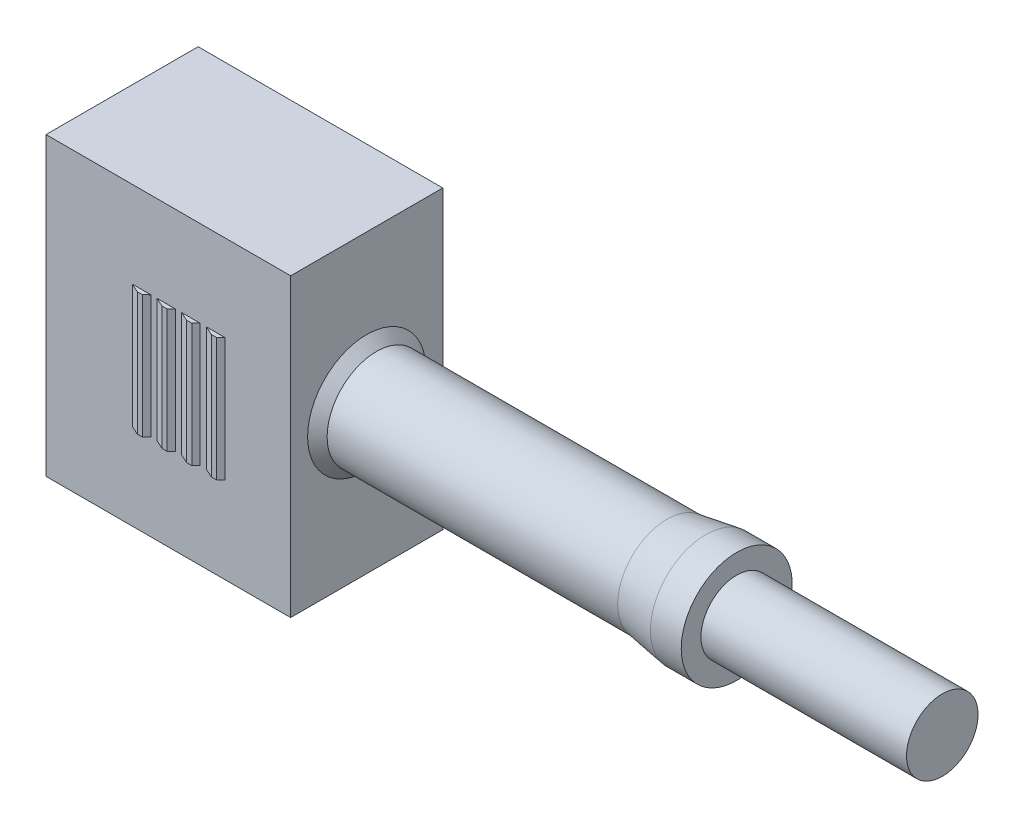
ISO-10303-21;
HEADER;
FILE_DESCRIPTION(('STEP AP214'),'2;1');
FILE_NAME('part.step','',(''),(''),'','','');
FILE_SCHEMA(('AUTOMOTIVE_DESIGN { 1 0 10303 214 1 1 1 1 }'));
ENDSEC;
DATA;
#1=APPLICATION_CONTEXT('core data for automotive mechanical design processes');
#2=APPLICATION_PROTOCOL_DEFINITION('international standard','automotive_design',2000,#1);
#3=PRODUCT_CONTEXT('',#1,'mechanical');
#4=PRODUCT('Part','Part','',(#3));
#5=PRODUCT_RELATED_PRODUCT_CATEGORY('part','',(#4));
#6=PRODUCT_DEFINITION_FORMATION('','',#4);
#7=PRODUCT_DEFINITION_CONTEXT('part definition',#1,'design');
#8=PRODUCT_DEFINITION('design','',#6,#7);
#9=PRODUCT_DEFINITION_SHAPE('','',#8);
#10=(LENGTH_UNIT() NAMED_UNIT(*) SI_UNIT(.MILLI.,.METRE.));
#11=(NAMED_UNIT(*) PLANE_ANGLE_UNIT() SI_UNIT($,.RADIAN.));
#12=(NAMED_UNIT(*) SI_UNIT($,.STERADIAN.) SOLID_ANGLE_UNIT());
#13=UNCERTAINTY_MEASURE_WITH_UNIT(LENGTH_MEASURE(1.E-05),#10,'distance_accuracy_value','');
#14=(GEOMETRIC_REPRESENTATION_CONTEXT(3) GLOBAL_UNCERTAINTY_ASSIGNED_CONTEXT((#13)) GLOBAL_UNIT_ASSIGNED_CONTEXT((#10,
#11,#12)) REPRESENTATION_CONTEXT('',''));
#15=CARTESIAN_POINT('',(0.,0.,0.));
#16=DIRECTION('',(0.,0.,1.));
#17=DIRECTION('',(1.,0.,0.));
#18=AXIS2_PLACEMENT_3D('',#15,#16,#17);
#19=CARTESIAN_POINT('',(5.95,-7.2,3.7));
#20=DIRECTION('',(-1.,0.,0.));
#21=DIRECTION('',(0.,0.,1.));
#22=AXIS2_PLACEMENT_3D('',#19,#20,#21);
#23=PLANE('',#22);
#24=DIRECTION('',(0.,1.,0.));
#25=VECTOR('',#24,1.);
#26=CARTESIAN_POINT('',(5.95,-7.2,-3.7));
#27=LINE('',#26,#25);
#28=CARTESIAN_POINT('',(5.95,-7.2,-3.7));
#29=VERTEX_POINT('',#28);
#30=CARTESIAN_POINT('',(5.95,7.2,-3.7));
#31=VERTEX_POINT('',#30);
#32=EDGE_CURVE('E384',#29,#31,#27,.T.);
#33=ORIENTED_EDGE('',*,*,#32,.T.);
#34=DIRECTION('',(0.,0.,-1.));
#35=VECTOR('',#34,1.);
#36=CARTESIAN_POINT('',(5.95,7.2,3.7));
#37=LINE('',#36,#35);
#38=CARTESIAN_POINT('',(5.95,7.2,3.7));
#39=VERTEX_POINT('',#38);
#40=EDGE_CURVE('E389',#39,#31,#37,.T.);
#41=ORIENTED_EDGE('',*,*,#40,.F.);
#42=DIRECTION('',(0.,1.,0.));
#43=VECTOR('',#42,1.);
#44=CARTESIAN_POINT('',(5.95,-7.2,3.7));
#45=LINE('',#44,#43);
#46=CARTESIAN_POINT('',(5.95,-7.2,3.7));
#47=VERTEX_POINT('',#46);
#48=EDGE_CURVE('E375',#47,#39,#45,.T.);
#49=ORIENTED_EDGE('',*,*,#48,.F.);
#50=DIRECTION('',(0.,0.,-1.));
#51=VECTOR('',#50,1.);
#52=CARTESIAN_POINT('',(5.95,-7.2,3.7));
#53=LINE('',#52,#51);
#54=EDGE_CURVE('E392',#47,#29,#53,.T.);
#55=ORIENTED_EDGE('',*,*,#54,.T.);
#56=EDGE_LOOP('',(#33,#41,#49,#55));
#57=FACE_BOUND('',#56,.T.);
#58=CARTESIAN_POINT('',(5.95,0.,0.));
#59=DIRECTION('',(-1.,0.,0.));
#60=DIRECTION('',(0.,0.,1.));
#61=AXIS2_PLACEMENT_3D('',#58,#59,#60);
#62=CIRCLE('',#61,2.875);
#63=CARTESIAN_POINT('',(5.95,0.,2.875));
#64=VERTEX_POINT('',#63);
#65=EDGE_CURVE('E11',#64,#64,#62,.F.);
#66=ORIENTED_EDGE('',*,*,#65,.F.);
#67=EDGE_LOOP('',(#66));
#68=FACE_BOUND('',#67,.T.);
#69=ADVANCED_FACE('F31',(#57,#68),#23,.F.);
#70=CARTESIAN_POINT('',(-5.95,-7.2,3.7));
#71=DIRECTION('',(1.,0.,0.));
#72=DIRECTION('',(0.,0.,-1.));
#73=AXIS2_PLACEMENT_3D('',#70,#71,#72);
#74=PLANE('',#73);
#75=DIRECTION('',(0.,0.,1.));
#76=VECTOR('',#75,1.);
#77=CARTESIAN_POINT('',(-5.95,-6.4,2.8));
#78=LINE('',#77,#76);
#79=CARTESIAN_POINT('',(-5.95,-6.4,-2.8));
#80=VERTEX_POINT('',#79);
#81=CARTESIAN_POINT('',(-5.95,-6.4,2.8));
#82=VERTEX_POINT('',#81);
#83=EDGE_CURVE('E222',#80,#82,#78,.T.);
#84=ORIENTED_EDGE('',*,*,#83,.F.);
#85=DIRECTION('',(0.,-1.,0.));
#86=VECTOR('',#85,1.);
#87=CARTESIAN_POINT('',(-5.95,-6.4,-2.8));
#88=LINE('',#87,#86);
#89=CARTESIAN_POINT('',(-5.95,6.4,-2.8));
#90=VERTEX_POINT('',#89);
#91=EDGE_CURVE('E46',#90,#80,#88,.T.);
#92=ORIENTED_EDGE('',*,*,#91,.F.);
#93=DIRECTION('',(0.,0.,-1.));
#94=VECTOR('',#93,1.);
#95=CARTESIAN_POINT('',(-5.95,6.4,2.8));
#96=LINE('',#95,#94);
#97=CARTESIAN_POINT('',(-5.95,6.4,2.8));
#98=VERTEX_POINT('',#97);
#99=EDGE_CURVE('E213',#98,#90,#96,.T.);
#100=ORIENTED_EDGE('',*,*,#99,.F.);
#101=DIRECTION('',(0.,1.,0.));
#102=VECTOR('',#101,1.);
#103=CARTESIAN_POINT('',(-5.95,-6.4,2.8));
#104=LINE('',#103,#102);
#105=EDGE_CURVE('E216',#82,#98,#104,.T.);
#106=ORIENTED_EDGE('',*,*,#105,.F.);
#107=EDGE_LOOP('',(#84,#92,#100,#106));
#108=FACE_BOUND('',#107,.T.);
#109=DIRECTION('',(0.,-1.,0.));
#110=VECTOR('',#109,1.);
#111=CARTESIAN_POINT('',(-5.95,-7.2,-3.7));
#112=LINE('',#111,#110);
#113=CARTESIAN_POINT('',(-5.95,7.2,-3.7));
#114=VERTEX_POINT('',#113);
#115=CARTESIAN_POINT('',(-5.95,-7.2,-3.7));
#116=VERTEX_POINT('',#115);
#117=EDGE_CURVE('E368',#114,#116,#112,.T.);
#118=ORIENTED_EDGE('',*,*,#117,.T.);
#119=DIRECTION('',(0.,0.,-1.));
#120=VECTOR('',#119,1.);
#121=CARTESIAN_POINT('',(-5.95,-7.2,3.7));
#122=LINE('',#121,#120);
#123=CARTESIAN_POINT('',(-5.95,-7.2,3.7));
#124=VERTEX_POINT('',#123);
#125=EDGE_CURVE('E39',#124,#116,#122,.T.);
#126=ORIENTED_EDGE('',*,*,#125,.F.);
#127=DIRECTION('',(0.,-1.,0.));
#128=VECTOR('',#127,1.);
#129=CARTESIAN_POINT('',(-5.95,-7.2,3.7));
#130=LINE('',#129,#128);
#131=CARTESIAN_POINT('',(-5.95,7.2,3.7));
#132=VERTEX_POINT('',#131);
#133=EDGE_CURVE('E369',#132,#124,#130,.T.);
#134=ORIENTED_EDGE('',*,*,#133,.F.);
#135=DIRECTION('',(0.,0.,-1.));
#136=VECTOR('',#135,1.);
#137=CARTESIAN_POINT('',(-5.95,7.2,3.7));
#138=LINE('',#137,#136);
#139=EDGE_CURVE('E379',#132,#114,#138,.T.);
#140=ORIENTED_EDGE('',*,*,#139,.T.);
#141=EDGE_LOOP('',(#118,#126,#134,#140));
#142=FACE_BOUND('',#141,.T.);
#143=ADVANCED_FACE('F33',(#108,#142),#74,.F.);
#144=CARTESIAN_POINT('',(5.95,-7.2,3.7));
#145=DIRECTION('',(0.,1.,0.));
#146=DIRECTION('',(0.,0.,1.));
#147=AXIS2_PLACEMENT_3D('',#144,#145,#146);
#148=PLANE('',#147);
#149=DIRECTION('',(1.,0.,0.));
#150=VECTOR('',#149,1.);
#151=CARTESIAN_POINT('',(5.95,-7.2,-3.7));
#152=LINE('',#151,#150);
#153=EDGE_CURVE('E382',#116,#29,#152,.T.);
#154=ORIENTED_EDGE('',*,*,#153,.T.);
#155=ORIENTED_EDGE('',*,*,#54,.F.);
#156=DIRECTION('',(1.,0.,0.));
#157=VECTOR('',#156,1.);
#158=CARTESIAN_POINT('',(5.95,-7.2,3.7));
#159=LINE('',#158,#157);
#160=EDGE_CURVE('E372',#124,#47,#159,.T.);
#161=ORIENTED_EDGE('',*,*,#160,.F.);
#162=ORIENTED_EDGE('',*,*,#125,.T.);
#163=EDGE_LOOP('',(#154,#155,#161,#162));
#164=FACE_BOUND('',#163,.T.);
#165=ADVANCED_FACE('F397',(#164),#148,.F.);
#166=CARTESIAN_POINT('',(5.95,7.2,3.7));
#167=DIRECTION('',(0.,-1.,0.));
#168=DIRECTION('',(1.,0.,0.));
#169=AXIS2_PLACEMENT_3D('',#166,#167,#168);
#170=PLANE('',#169);
#171=DIRECTION('',(-1.,0.,0.));
#172=VECTOR('',#171,1.);
#173=CARTESIAN_POINT('',(5.95,7.2,-3.7));
#174=LINE('',#173,#172);
#175=EDGE_CURVE('E373',#31,#114,#174,.T.);
#176=ORIENTED_EDGE('',*,*,#175,.T.);
#177=ORIENTED_EDGE('',*,*,#139,.F.);
#178=DIRECTION('',(-1.,0.,0.));
#179=VECTOR('',#178,1.);
#180=CARTESIAN_POINT('',(5.95,7.2,3.7));
#181=LINE('',#180,#179);
#182=EDGE_CURVE('E377',#39,#132,#181,.T.);
#183=ORIENTED_EDGE('',*,*,#182,.F.);
#184=ORIENTED_EDGE('',*,*,#40,.T.);
#185=EDGE_LOOP('',(#176,#177,#183,#184));
#186=FACE_BOUND('',#185,.T.);
#187=ADVANCED_FACE('F413',(#186),#170,.F.);
#188=CARTESIAN_POINT('',(-5.95,7.2,3.7));
#189=DIRECTION('',(0.,0.,1.));
#190=DIRECTION('',(1.,0.,0.));
#191=AXIS2_PLACEMENT_3D('',#188,#189,#190);
#192=PLANE('',#191);
#193=DIRECTION('',(-1.,0.,0.));
#194=VECTOR('',#193,1.);
#195=CARTESIAN_POINT('',(1.85,3.,3.7));
#196=LINE('',#195,#194);
#197=CARTESIAN_POINT('',(2.75,3.,3.7));
#198=VERTEX_POINT('',#197);
#199=CARTESIAN_POINT('',(1.85,3.,3.7));
#200=VERTEX_POINT('',#199);
#201=EDGE_CURVE('E239',#198,#200,#196,.T.);
#202=ORIENTED_EDGE('',*,*,#201,.F.);
#203=DIRECTION('',(0.,-1.,0.));
#204=VECTOR('',#203,1.);
#205=CARTESIAN_POINT('',(2.75,3.,3.7));
#206=LINE('',#205,#204);
#207=CARTESIAN_POINT('',(2.75,-3.,3.7));
#208=VERTEX_POINT('',#207);
#209=EDGE_CURVE('E250',#198,#208,#206,.T.);
#210=ORIENTED_EDGE('',*,*,#209,.T.);
#211=DIRECTION('',(-1.,0.,0.));
#212=VECTOR('',#211,1.);
#213=CARTESIAN_POINT('',(1.85,-3.,3.7));
#214=LINE('',#213,#212);
#215=CARTESIAN_POINT('',(1.85,-3.,3.7));
#216=VERTEX_POINT('',#215);
#217=EDGE_CURVE('E235',#208,#216,#214,.T.);
#218=ORIENTED_EDGE('',*,*,#217,.T.);
#219=DIRECTION('',(0.,-1.,0.));
#220=VECTOR('',#219,1.);
#221=CARTESIAN_POINT('',(1.85,3.,3.7));
#222=LINE('',#221,#220);
#223=EDGE_CURVE('E241',#200,#216,#222,.T.);
#224=ORIENTED_EDGE('',*,*,#223,.F.);
#225=EDGE_LOOP('',(#202,#210,#218,#224));
#226=FACE_BOUND('',#225,.T.);
#227=DIRECTION('',(-1.,0.,0.));
#228=VECTOR('',#227,1.);
#229=CARTESIAN_POINT('',(0.650000000000001,3.,3.7));
#230=LINE('',#229,#228);
#231=CARTESIAN_POINT('',(1.55,3.,3.7));
#232=VERTEX_POINT('',#231);
#233=CARTESIAN_POINT('',(0.650000000000001,3.,3.7));
#234=VERTEX_POINT('',#233);
#235=EDGE_CURVE('E268',#232,#234,#230,.T.);
#236=ORIENTED_EDGE('',*,*,#235,.F.);
#237=DIRECTION('',(0.,-1.,0.));
#238=VECTOR('',#237,1.);
#239=CARTESIAN_POINT('',(1.55,3.,3.7));
#240=LINE('',#239,#238);
#241=CARTESIAN_POINT('',(1.55,-3.,3.7));
#242=VERTEX_POINT('',#241);
#243=EDGE_CURVE('E281',#232,#242,#240,.T.);
#244=ORIENTED_EDGE('',*,*,#243,.T.);
#245=DIRECTION('',(-1.,0.,0.));
#246=VECTOR('',#245,1.);
#247=CARTESIAN_POINT('',(0.650000000000001,-3.,3.7));
#248=LINE('',#247,#246);
#249=CARTESIAN_POINT('',(0.65,-3.,3.7));
#250=VERTEX_POINT('',#249);
#251=EDGE_CURVE('E264',#242,#250,#248,.T.);
#252=ORIENTED_EDGE('',*,*,#251,.T.);
#253=DIRECTION('',(0.,-1.,0.));
#254=VECTOR('',#253,1.);
#255=CARTESIAN_POINT('',(0.650000000000001,3.,3.7));
#256=LINE('',#255,#254);
#257=EDGE_CURVE('E270',#234,#250,#256,.T.);
#258=ORIENTED_EDGE('',*,*,#257,.F.);
#259=EDGE_LOOP('',(#236,#244,#252,#258));
#260=FACE_BOUND('',#259,.T.);
#261=DIRECTION('',(-1.,0.,0.));
#262=VECTOR('',#261,1.);
#263=CARTESIAN_POINT('',(-0.549999999999999,3.,3.7));
#264=LINE('',#263,#262);
#265=CARTESIAN_POINT('',(0.350000000000001,3.,3.7));
#266=VERTEX_POINT('',#265);
#267=CARTESIAN_POINT('',(-0.549999999999999,3.,3.7));
#268=VERTEX_POINT('',#267);
#269=EDGE_CURVE('E299',#266,#268,#264,.T.);
#270=ORIENTED_EDGE('',*,*,#269,.F.);
#271=DIRECTION('',(0.,-1.,0.));
#272=VECTOR('',#271,1.);
#273=CARTESIAN_POINT('',(0.350000000000001,3.,3.7));
#274=LINE('',#273,#272);
#275=CARTESIAN_POINT('',(0.350000000000001,-3.,3.7));
#276=VERTEX_POINT('',#275);
#277=EDGE_CURVE('E312',#266,#276,#274,.T.);
#278=ORIENTED_EDGE('',*,*,#277,.T.);
#279=DIRECTION('',(-1.,0.,0.));
#280=VECTOR('',#279,1.);
#281=CARTESIAN_POINT('',(-0.549999999999999,-3.,3.7));
#282=LINE('',#281,#280);
#283=CARTESIAN_POINT('',(-0.549999999999999,-3.,3.7));
#284=VERTEX_POINT('',#283);
#285=EDGE_CURVE('E295',#276,#284,#282,.T.);
#286=ORIENTED_EDGE('',*,*,#285,.T.);
#287=DIRECTION('',(0.,-1.,0.));
#288=VECTOR('',#287,1.);
#289=CARTESIAN_POINT('',(-0.549999999999999,3.,3.7));
#290=LINE('',#289,#288);
#291=EDGE_CURVE('E301',#268,#284,#290,.T.);
#292=ORIENTED_EDGE('',*,*,#291,.F.);
#293=EDGE_LOOP('',(#270,#278,#286,#292));
#294=FACE_BOUND('',#293,.T.);
#295=DIRECTION('',(-1.,0.,0.));
#296=VECTOR('',#295,1.);
#297=CARTESIAN_POINT('',(-1.75,3.,3.7));
#298=LINE('',#297,#296);
#299=CARTESIAN_POINT('',(-0.849999999999999,3.,3.7));
#300=VERTEX_POINT('',#299);
#301=CARTESIAN_POINT('',(-1.75,3.,3.7));
#302=VERTEX_POINT('',#301);
#303=EDGE_CURVE('E322',#300,#302,#298,.T.);
#304=ORIENTED_EDGE('',*,*,#303,.F.);
#305=DIRECTION('',(0.,-1.,0.));
#306=VECTOR('',#305,1.);
#307=CARTESIAN_POINT('',(-0.849999999999999,3.,3.7));
#308=LINE('',#307,#306);
#309=CARTESIAN_POINT('',(-0.849999999999999,-3.,3.7));
#310=VERTEX_POINT('',#309);
#311=EDGE_CURVE('E332',#300,#310,#308,.T.);
#312=ORIENTED_EDGE('',*,*,#311,.T.);
#313=DIRECTION('',(-1.,0.,0.));
#314=VECTOR('',#313,1.);
#315=CARTESIAN_POINT('',(-1.75,-3.,3.7));
#316=LINE('',#315,#314);
#317=CARTESIAN_POINT('',(-1.75,-3.,3.7));
#318=VERTEX_POINT('',#317);
#319=EDGE_CURVE('E321',#310,#318,#316,.T.);
#320=ORIENTED_EDGE('',*,*,#319,.T.);
#321=DIRECTION('',(0.,-1.,0.));
#322=VECTOR('',#321,1.);
#323=CARTESIAN_POINT('',(-1.75,3.,3.7));
#324=LINE('',#323,#322);
#325=EDGE_CURVE('E348',#302,#318,#324,.T.);
#326=ORIENTED_EDGE('',*,*,#325,.F.);
#327=EDGE_LOOP('',(#304,#312,#320,#326));
#328=FACE_BOUND('',#327,.T.);
#329=ORIENTED_EDGE('',*,*,#133,.T.);
#330=ORIENTED_EDGE('',*,*,#160,.T.);
#331=ORIENTED_EDGE('',*,*,#48,.T.);
#332=ORIENTED_EDGE('',*,*,#182,.T.);
#333=EDGE_LOOP('',(#329,#330,#331,#332));
#334=FACE_BOUND('',#333,.T.);
#335=ADVANCED_FACE('F415',(#226,#260,#294,#328,#334),#192,.T.);
#336=CARTESIAN_POINT('',(-5.95,7.2,-3.7));
#337=DIRECTION('',(0.,0.,1.));
#338=DIRECTION('',(1.,0.,0.));
#339=AXIS2_PLACEMENT_3D('',#336,#337,#338);
#340=PLANE('',#339);
#341=ORIENTED_EDGE('',*,*,#117,.F.);
#342=ORIENTED_EDGE('',*,*,#175,.F.);
#343=ORIENTED_EDGE('',*,*,#32,.F.);
#344=ORIENTED_EDGE('',*,*,#153,.F.);
#345=EDGE_LOOP('',(#341,#342,#343,#344));
#346=FACE_BOUND('',#345,.T.);
#347=ADVANCED_FACE('F405',(#346),#340,.F.);
#348=CARTESIAN_POINT('',(6.42499999999999,0.,0.));
#349=DIRECTION('',(-1.,0.,0.));
#350=DIRECTION('',(0.,0.,1.));
#351=AXIS2_PLACEMENT_3D('',#348,#349,#350);
#352=CONICAL_SURFACE('',#351,2.4,0.785398163397456);
#353=ORIENTED_EDGE('',*,*,#65,.T.);
#354=EDGE_LOOP('',(#353));
#355=FACE_BOUND('',#354,.T.);
#356=CARTESIAN_POINT('',(6.42499999999999,0.,0.));
#357=DIRECTION('',(-1.,0.,0.));
#358=DIRECTION('',(0.,0.,1.));
#359=AXIS2_PLACEMENT_3D('',#356,#357,#358);
#360=CIRCLE('',#359,2.4);
#361=CARTESIAN_POINT('',(6.42499999999999,0.,2.4));
#362=VERTEX_POINT('',#361);
#363=EDGE_CURVE('E365',#362,#362,#360,.T.);
#364=ORIENTED_EDGE('',*,*,#363,.T.);
#365=EDGE_LOOP('',(#364));
#366=FACE_BOUND('',#365,.T.);
#367=ADVANCED_FACE('F423',(#355,#366),#352,.T.);
#368=CARTESIAN_POINT('',(0.,0.,0.));
#369=DIRECTION('',(-1.,0.,0.));
#370=DIRECTION('',(0.,0.,1.));
#371=AXIS2_PLACEMENT_3D('',#368,#369,#370);
#372=CYLINDRICAL_SURFACE('',#371,2.4);
#373=ORIENTED_EDGE('',*,*,#363,.F.);
#374=EDGE_LOOP('',(#373));
#375=FACE_BOUND('',#374,.T.);
#376=CARTESIAN_POINT('',(20.5558745455975,0.,0.));
#377=DIRECTION('',(-1.,0.,0.));
#378=DIRECTION('',(0.,0.,1.));
#379=AXIS2_PLACEMENT_3D('',#376,#377,#378);
#380=CIRCLE('',#379,2.4);
#381=CARTESIAN_POINT('',(20.5558745455975,0.,2.4));
#382=VERTEX_POINT('',#381);
#383=EDGE_CURVE('E362',#382,#382,#380,.T.);
#384=ORIENTED_EDGE('',*,*,#383,.T.);
#385=EDGE_LOOP('',(#384));
#386=FACE_BOUND('',#385,.T.);
#387=ADVANCED_FACE('F464',(#375,#386),#372,.T.);
#388=CARTESIAN_POINT('',(22.45,0.,0.));
#389=DIRECTION('',(1.,0.,0.));
#390=DIRECTION('',(0.,0.,-1.));
#391=AXIS2_PLACEMENT_3D('',#388,#389,#390);
#392=CONICAL_SURFACE('',#391,2.7,0.15707963267949);
#393=ORIENTED_EDGE('',*,*,#383,.F.);
#394=EDGE_LOOP('',(#393));
#395=FACE_BOUND('',#394,.T.);
#396=CARTESIAN_POINT('',(22.45,0.,0.));
#397=DIRECTION('',(-1.,0.,0.));
#398=DIRECTION('',(0.,0.,1.));
#399=AXIS2_PLACEMENT_3D('',#396,#397,#398);
#400=CIRCLE('',#399,2.7);
#401=CARTESIAN_POINT('',(22.45,0.,2.7));
#402=VERTEX_POINT('',#401);
#403=EDGE_CURVE('E359',#402,#402,#400,.T.);
#404=ORIENTED_EDGE('',*,*,#403,.T.);
#405=EDGE_LOOP('',(#404));
#406=FACE_BOUND('',#405,.T.);
#407=ADVANCED_FACE('F473',(#395,#406),#392,.T.);
#408=CARTESIAN_POINT('',(0.,0.,0.));
#409=DIRECTION('',(-1.,0.,0.));
#410=DIRECTION('',(0.,0.,1.));
#411=AXIS2_PLACEMENT_3D('',#408,#409,#410);
#412=CYLINDRICAL_SURFACE('',#411,2.7);
#413=ORIENTED_EDGE('',*,*,#403,.F.);
#414=EDGE_LOOP('',(#413));
#415=FACE_BOUND('',#414,.T.);
#416=CARTESIAN_POINT('',(23.95,0.,0.));
#417=DIRECTION('',(-1.,0.,0.));
#418=DIRECTION('',(0.,0.,1.));
#419=AXIS2_PLACEMENT_3D('',#416,#417,#418);
#420=CIRCLE('',#419,2.7);
#421=CARTESIAN_POINT('',(23.95,0.,2.7));
#422=VERTEX_POINT('',#421);
#423=EDGE_CURVE('E356',#422,#422,#420,.T.);
#424=ORIENTED_EDGE('',*,*,#423,.T.);
#425=EDGE_LOOP('',(#424));
#426=FACE_BOUND('',#425,.T.);
#427=ADVANCED_FACE('F483',(#415,#426),#412,.T.);
#428=CARTESIAN_POINT('',(23.95,2.7,0.));
#429=DIRECTION('',(-1.,0.,0.));
#430=DIRECTION('',(0.,0.,1.));
#431=AXIS2_PLACEMENT_3D('',#428,#429,#430);
#432=PLANE('',#431);
#433=ORIENTED_EDGE('',*,*,#423,.F.);
#434=EDGE_LOOP('',(#433));
#435=FACE_BOUND('',#434,.T.);
#436=CARTESIAN_POINT('',(23.95,0.,0.));
#437=DIRECTION('',(-1.,0.,0.));
#438=DIRECTION('',(0.,0.,1.));
#439=AXIS2_PLACEMENT_3D('',#436,#437,#438);
#440=CIRCLE('',#439,1.74);
#441=CARTESIAN_POINT('',(23.95,0.,1.74));
#442=VERTEX_POINT('',#441);
#443=EDGE_CURVE('E353',#442,#442,#440,.T.);
#444=ORIENTED_EDGE('',*,*,#443,.T.);
#445=EDGE_LOOP('',(#444));
#446=FACE_BOUND('',#445,.T.);
#447=ADVANCED_FACE('F493',(#435,#446),#432,.F.);
#448=CARTESIAN_POINT('',(0.,0.,0.));
#449=DIRECTION('',(-1.,0.,0.));
#450=DIRECTION('',(0.,0.,1.));
#451=AXIS2_PLACEMENT_3D('',#448,#449,#450);
#452=CYLINDRICAL_SURFACE('',#451,1.74);
#453=ORIENTED_EDGE('',*,*,#443,.F.);
#454=EDGE_LOOP('',(#453));
#455=FACE_BOUND('',#454,.T.);
#456=CARTESIAN_POINT('',(33.95,0.,0.));
#457=DIRECTION('',(-1.,0.,0.));
#458=DIRECTION('',(0.,0.,1.));
#459=AXIS2_PLACEMENT_3D('',#456,#457,#458);
#460=CIRCLE('',#459,1.74);
#461=CARTESIAN_POINT('',(33.95,0.,1.74));
#462=VERTEX_POINT('',#461);
#463=EDGE_CURVE('E350',#462,#462,#460,.T.);
#464=ORIENTED_EDGE('',*,*,#463,.T.);
#465=EDGE_LOOP('',(#464));
#466=FACE_BOUND('',#465,.T.);
#467=ADVANCED_FACE('F503',(#455,#466),#452,.T.);
#468=CARTESIAN_POINT('',(33.95,1.74,0.));
#469=DIRECTION('',(-1.,0.,0.));
#470=DIRECTION('',(0.,0.,1.));
#471=AXIS2_PLACEMENT_3D('',#468,#469,#470);
#472=PLANE('',#471);
#473=ORIENTED_EDGE('',*,*,#463,.F.);
#474=EDGE_LOOP('',(#473));
#475=FACE_BOUND('',#474,.T.);
#476=ADVANCED_FACE('F513',(#475),#472,.F.);
#477=CARTESIAN_POINT('',(-1.75,3.,3.7));
#478=DIRECTION('',(0.413802944301184,0.,-0.910366477462605));
#479=DIRECTION('',(-0.910366477462605,0.,-0.413802944301184));
#480=AXIS2_PLACEMENT_3D('',#477,#478,#479);
#481=PLANE('',#480);
#482=DIRECTION('',(0.910366477462605,0.,0.413802944301184));
#483=VECTOR('',#482,1.);
#484=CARTESIAN_POINT('',(-1.75,-3.,3.7));
#485=LINE('',#484,#483);
#486=CARTESIAN_POINT('',(-1.31,-3.,3.9));
#487=VERTEX_POINT('',#486);
#488=EDGE_CURVE('E335',#318,#487,#485,.T.);
#489=ORIENTED_EDGE('',*,*,#488,.T.);
#490=DIRECTION('',(0.,-1.,0.));
#491=VECTOR('',#490,1.);
#492=CARTESIAN_POINT('',(-1.31,3.,3.9));
#493=LINE('',#492,#491);
#494=CARTESIAN_POINT('',(-1.31,3.,3.9));
#495=VERTEX_POINT('',#494);
#496=EDGE_CURVE('E345',#495,#487,#493,.T.);
#497=ORIENTED_EDGE('',*,*,#496,.F.);
#498=DIRECTION('',(0.910366477462605,0.,0.413802944301184));
#499=VECTOR('',#498,1.);
#500=CARTESIAN_POINT('',(-1.75,3.,3.7));
#501=LINE('',#500,#499);
#502=EDGE_CURVE('E325',#302,#495,#501,.T.);
#503=ORIENTED_EDGE('',*,*,#502,.F.);
#504=ORIENTED_EDGE('',*,*,#325,.T.);
#505=EDGE_LOOP('',(#489,#497,#503,#504));
#506=FACE_BOUND('',#505,.T.);
#507=ADVANCED_FACE('F522',(#506),#481,.F.);
#508=CARTESIAN_POINT('',(-1.31,3.,3.9));
#509=DIRECTION('',(0.,0.,-1.));
#510=DIRECTION('',(-1.,0.,0.));
#511=AXIS2_PLACEMENT_3D('',#508,#509,#510);
#512=PLANE('',#511);
#513=DIRECTION('',(1.,0.,0.));
#514=VECTOR('',#513,1.);
#515=CARTESIAN_POINT('',(-1.31,-3.,3.9));
#516=LINE('',#515,#514);
#517=CARTESIAN_POINT('',(-1.06,-3.,3.9));
#518=VERTEX_POINT('',#517);
#519=EDGE_CURVE('E337',#487,#518,#516,.T.);
#520=ORIENTED_EDGE('',*,*,#519,.T.);
#521=DIRECTION('',(0.,-1.,0.));
#522=VECTOR('',#521,1.);
#523=CARTESIAN_POINT('',(-1.06,3.,3.9));
#524=LINE('',#523,#522);
#525=CARTESIAN_POINT('',(-1.06,3.,3.9));
#526=VERTEX_POINT('',#525);
#527=EDGE_CURVE('E342',#526,#518,#524,.T.);
#528=ORIENTED_EDGE('',*,*,#527,.F.);
#529=DIRECTION('',(1.,0.,0.));
#530=VECTOR('',#529,1.);
#531=CARTESIAN_POINT('',(-1.31,3.,3.9));
#532=LINE('',#531,#530);
#533=EDGE_CURVE('E328',#495,#526,#532,.T.);
#534=ORIENTED_EDGE('',*,*,#533,.F.);
#535=ORIENTED_EDGE('',*,*,#496,.T.);
#536=EDGE_LOOP('',(#520,#528,#534,#535));
#537=FACE_BOUND('',#536,.T.);
#538=ADVANCED_FACE('F536',(#537),#512,.F.);
#539=CARTESIAN_POINT('',(-1.06,3.,3.9));
#540=DIRECTION('',(-0.689655172413793,0.,-0.724137931034482));
#541=DIRECTION('',(-0.724137931034482,0.,0.689655172413793));
#542=AXIS2_PLACEMENT_3D('',#539,#540,#541);
#543=PLANE('',#542);
#544=DIRECTION('',(0.724137931034482,0.,-0.689655172413793));
#545=VECTOR('',#544,1.);
#546=CARTESIAN_POINT('',(-1.06,-3.,3.9));
#547=LINE('',#546,#545);
#548=EDGE_CURVE('E326',#518,#310,#547,.T.);
#549=ORIENTED_EDGE('',*,*,#548,.T.);
#550=ORIENTED_EDGE('',*,*,#311,.F.);
#551=DIRECTION('',(0.724137931034482,0.,-0.689655172413793));
#552=VECTOR('',#551,1.);
#553=CARTESIAN_POINT('',(-1.06,3.,3.9));
#554=LINE('',#553,#552);
#555=EDGE_CURVE('E330',#526,#300,#554,.T.);
#556=ORIENTED_EDGE('',*,*,#555,.F.);
#557=ORIENTED_EDGE('',*,*,#527,.T.);
#558=EDGE_LOOP('',(#549,#550,#556,#557));
#559=FACE_BOUND('',#558,.T.);
#560=ADVANCED_FACE('F546',(#559),#543,.F.);
#561=CARTESIAN_POINT('',(-0.849999999999999,3.,3.7));
#562=DIRECTION('',(0.,1.,0.));
#563=DIRECTION('',(0.,0.,1.));
#564=AXIS2_PLACEMENT_3D('',#561,#562,#563);
#565=PLANE('',#564);
#566=ORIENTED_EDGE('',*,*,#303,.T.);
#567=ORIENTED_EDGE('',*,*,#502,.T.);
#568=ORIENTED_EDGE('',*,*,#533,.T.);
#569=ORIENTED_EDGE('',*,*,#555,.T.);
#570=EDGE_LOOP('',(#566,#567,#568,#569));
#571=FACE_BOUND('',#570,.T.);
#572=ADVANCED_FACE('F556',(#571),#565,.T.);
#573=CARTESIAN_POINT('',(-0.849999999999999,-3.,3.7));
#574=DIRECTION('',(0.,1.,0.));
#575=DIRECTION('',(0.,0.,1.));
#576=AXIS2_PLACEMENT_3D('',#573,#574,#575);
#577=PLANE('',#576);
#578=ORIENTED_EDGE('',*,*,#319,.F.);
#579=ORIENTED_EDGE('',*,*,#548,.F.);
#580=ORIENTED_EDGE('',*,*,#519,.F.);
#581=ORIENTED_EDGE('',*,*,#488,.F.);
#582=EDGE_LOOP('',(#578,#579,#580,#581));
#583=FACE_BOUND('',#582,.T.);
#584=ADVANCED_FACE('F566',(#583),#577,.F.);
#585=CARTESIAN_POINT('',(-0.549999999999999,3.,3.7));
#586=DIRECTION('',(0.413802944301184,0.,-0.910366477462605));
#587=DIRECTION('',(-0.910366477462605,0.,-0.413802944301184));
#588=AXIS2_PLACEMENT_3D('',#585,#586,#587);
#589=PLANE('',#588);
#590=DIRECTION('',(0.910366477462605,0.,0.413802944301184));
#591=VECTOR('',#590,1.);
#592=CARTESIAN_POINT('',(-0.549999999999999,-3.,3.7));
#593=LINE('',#592,#591);
#594=CARTESIAN_POINT('',(-0.109999999999999,-3.,3.9));
#595=VERTEX_POINT('',#594);
#596=EDGE_CURVE('E290',#284,#595,#593,.T.);
#597=ORIENTED_EDGE('',*,*,#596,.T.);
#598=DIRECTION('',(0.,-1.,0.));
#599=VECTOR('',#598,1.);
#600=CARTESIAN_POINT('',(-0.109999999999999,3.,3.9));
#601=LINE('',#600,#599);
#602=CARTESIAN_POINT('',(-0.109999999999999,3.,3.9));
#603=VERTEX_POINT('',#602);
#604=EDGE_CURVE('E318',#603,#595,#601,.T.);
#605=ORIENTED_EDGE('',*,*,#604,.F.);
#606=DIRECTION('',(0.910366477462605,0.,0.413802944301184));
#607=VECTOR('',#606,1.);
#608=CARTESIAN_POINT('',(-0.549999999999999,3.,3.7));
#609=LINE('',#608,#607);
#610=EDGE_CURVE('E291',#268,#603,#609,.T.);
#611=ORIENTED_EDGE('',*,*,#610,.F.);
#612=ORIENTED_EDGE('',*,*,#291,.T.);
#613=EDGE_LOOP('',(#597,#605,#611,#612));
#614=FACE_BOUND('',#613,.T.);
#615=ADVANCED_FACE('F576',(#614),#589,.F.);
#616=CARTESIAN_POINT('',(-0.109999999999999,3.,3.9));
#617=DIRECTION('',(0.,0.,-1.));
#618=DIRECTION('',(-1.,0.,0.));
#619=AXIS2_PLACEMENT_3D('',#616,#617,#618);
#620=PLANE('',#619);
#621=DIRECTION('',(1.,0.,0.));
#622=VECTOR('',#621,1.);
#623=CARTESIAN_POINT('',(-0.109999999999999,-3.,3.9));
#624=LINE('',#623,#622);
#625=CARTESIAN_POINT('',(0.140000000000001,-3.,3.9));
#626=VERTEX_POINT('',#625);
#627=EDGE_CURVE('E304',#595,#626,#624,.T.);
#628=ORIENTED_EDGE('',*,*,#627,.T.);
#629=DIRECTION('',(0.,-1.,0.));
#630=VECTOR('',#629,1.);
#631=CARTESIAN_POINT('',(0.140000000000001,3.,3.9));
#632=LINE('',#631,#630);
#633=CARTESIAN_POINT('',(0.140000000000001,3.,3.9));
#634=VERTEX_POINT('',#633);
#635=EDGE_CURVE('E315',#634,#626,#632,.T.);
#636=ORIENTED_EDGE('',*,*,#635,.F.);
#637=DIRECTION('',(1.,0.,0.));
#638=VECTOR('',#637,1.);
#639=CARTESIAN_POINT('',(-0.109999999999999,3.,3.9));
#640=LINE('',#639,#638);
#641=EDGE_CURVE('E294',#603,#634,#640,.T.);
#642=ORIENTED_EDGE('',*,*,#641,.F.);
#643=ORIENTED_EDGE('',*,*,#604,.T.);
#644=EDGE_LOOP('',(#628,#636,#642,#643));
#645=FACE_BOUND('',#644,.T.);
#646=ADVANCED_FACE('F586',(#645),#620,.F.);
#647=CARTESIAN_POINT('',(0.140000000000001,3.,3.9));
#648=DIRECTION('',(-0.689655172413793,0.,-0.724137931034482));
#649=DIRECTION('',(-0.724137931034482,0.,0.689655172413793));
#650=AXIS2_PLACEMENT_3D('',#647,#648,#649);
#651=PLANE('',#650);
#652=DIRECTION('',(0.724137931034482,0.,-0.689655172413793));
#653=VECTOR('',#652,1.);
#654=CARTESIAN_POINT('',(0.140000000000001,-3.,3.9));
#655=LINE('',#654,#653);
#656=EDGE_CURVE('E306',#626,#276,#655,.T.);
#657=ORIENTED_EDGE('',*,*,#656,.T.);
#658=ORIENTED_EDGE('',*,*,#277,.F.);
#659=DIRECTION('',(0.724137931034482,0.,-0.689655172413793));
#660=VECTOR('',#659,1.);
#661=CARTESIAN_POINT('',(0.140000000000001,3.,3.9));
#662=LINE('',#661,#660);
#663=EDGE_CURVE('E297',#634,#266,#662,.T.);
#664=ORIENTED_EDGE('',*,*,#663,.F.);
#665=ORIENTED_EDGE('',*,*,#635,.T.);
#666=EDGE_LOOP('',(#657,#658,#664,#665));
#667=FACE_BOUND('',#666,.T.);
#668=ADVANCED_FACE('F596',(#667),#651,.F.);
#669=CARTESIAN_POINT('',(0.05923076923077,3.,3.97692307692308));
#670=DIRECTION('',(0.,1.,0.));
#671=DIRECTION('',(0.,0.,1.));
#672=AXIS2_PLACEMENT_3D('',#669,#670,#671);
#673=PLANE('',#672);
#674=ORIENTED_EDGE('',*,*,#610,.T.);
#675=ORIENTED_EDGE('',*,*,#641,.T.);
#676=ORIENTED_EDGE('',*,*,#663,.T.);
#677=ORIENTED_EDGE('',*,*,#269,.T.);
#678=EDGE_LOOP('',(#674,#675,#676,#677));
#679=FACE_BOUND('',#678,.T.);
#680=ADVANCED_FACE('F606',(#679),#673,.T.);
#681=CARTESIAN_POINT('',(0.05923076923077,-3.,3.97692307692308));
#682=DIRECTION('',(0.,1.,0.));
#683=DIRECTION('',(0.,0.,1.));
#684=AXIS2_PLACEMENT_3D('',#681,#682,#683);
#685=PLANE('',#684);
#686=ORIENTED_EDGE('',*,*,#596,.F.);
#687=ORIENTED_EDGE('',*,*,#285,.F.);
#688=ORIENTED_EDGE('',*,*,#656,.F.);
#689=ORIENTED_EDGE('',*,*,#627,.F.);
#690=EDGE_LOOP('',(#686,#687,#688,#689));
#691=FACE_BOUND('',#690,.T.);
#692=ADVANCED_FACE('F616',(#691),#685,.F.);
#693=CARTESIAN_POINT('',(0.650000000000001,3.,3.7));
#694=DIRECTION('',(0.413802944301184,0.,-0.910366477462605));
#695=DIRECTION('',(-0.910366477462605,0.,-0.413802944301184));
#696=AXIS2_PLACEMENT_3D('',#693,#694,#695);
#697=PLANE('',#696);
#698=DIRECTION('',(0.910366477462605,0.,0.413802944301184));
#699=VECTOR('',#698,1.);
#700=CARTESIAN_POINT('',(0.650000000000001,-3.,3.7));
#701=LINE('',#700,#699);
#702=CARTESIAN_POINT('',(1.09,-3.,3.9));
#703=VERTEX_POINT('',#702);
#704=EDGE_CURVE('E259',#250,#703,#701,.T.);
#705=ORIENTED_EDGE('',*,*,#704,.T.);
#706=DIRECTION('',(0.,-1.,0.));
#707=VECTOR('',#706,1.);
#708=CARTESIAN_POINT('',(1.09,3.,3.9));
#709=LINE('',#708,#707);
#710=CARTESIAN_POINT('',(1.09,3.,3.9));
#711=VERTEX_POINT('',#710);
#712=EDGE_CURVE('E287',#711,#703,#709,.T.);
#713=ORIENTED_EDGE('',*,*,#712,.F.);
#714=DIRECTION('',(0.910366477462605,0.,0.413802944301184));
#715=VECTOR('',#714,1.);
#716=CARTESIAN_POINT('',(0.650000000000001,3.,3.7));
#717=LINE('',#716,#715);
#718=EDGE_CURVE('E260',#234,#711,#717,.T.);
#719=ORIENTED_EDGE('',*,*,#718,.F.);
#720=ORIENTED_EDGE('',*,*,#257,.T.);
#721=EDGE_LOOP('',(#705,#713,#719,#720));
#722=FACE_BOUND('',#721,.T.);
#723=ADVANCED_FACE('F626',(#722),#697,.F.);
#724=CARTESIAN_POINT('',(1.09,3.,3.9));
#725=DIRECTION('',(0.,0.,-1.));
#726=DIRECTION('',(-1.,0.,0.));
#727=AXIS2_PLACEMENT_3D('',#724,#725,#726);
#728=PLANE('',#727);
#729=DIRECTION('',(1.,0.,0.));
#730=VECTOR('',#729,1.);
#731=CARTESIAN_POINT('',(1.09,-3.,3.9));
#732=LINE('',#731,#730);
#733=CARTESIAN_POINT('',(1.34,-3.,3.9));
#734=VERTEX_POINT('',#733);
#735=EDGE_CURVE('E273',#703,#734,#732,.T.);
#736=ORIENTED_EDGE('',*,*,#735,.T.);
#737=DIRECTION('',(0.,-1.,0.));
#738=VECTOR('',#737,1.);
#739=CARTESIAN_POINT('',(1.34,3.,3.9));
#740=LINE('',#739,#738);
#741=CARTESIAN_POINT('',(1.34,3.,3.9));
#742=VERTEX_POINT('',#741);
#743=EDGE_CURVE('E284',#742,#734,#740,.T.);
#744=ORIENTED_EDGE('',*,*,#743,.F.);
#745=DIRECTION('',(1.,0.,0.));
#746=VECTOR('',#745,1.);
#747=CARTESIAN_POINT('',(1.09,3.,3.9));
#748=LINE('',#747,#746);
#749=EDGE_CURVE('E263',#711,#742,#748,.T.);
#750=ORIENTED_EDGE('',*,*,#749,.F.);
#751=ORIENTED_EDGE('',*,*,#712,.T.);
#752=EDGE_LOOP('',(#736,#744,#750,#751));
#753=FACE_BOUND('',#752,.T.);
#754=ADVANCED_FACE('F636',(#753),#728,.F.);
#755=CARTESIAN_POINT('',(1.34,3.,3.9));
#756=DIRECTION('',(-0.689655172413793,0.,-0.724137931034482));
#757=DIRECTION('',(-0.724137931034482,0.,0.689655172413793));
#758=AXIS2_PLACEMENT_3D('',#755,#756,#757);
#759=PLANE('',#758);
#760=DIRECTION('',(0.724137931034482,0.,-0.689655172413793));
#761=VECTOR('',#760,1.);
#762=CARTESIAN_POINT('',(1.34,-3.,3.9));
#763=LINE('',#762,#761);
#764=EDGE_CURVE('E275',#734,#242,#763,.T.);
#765=ORIENTED_EDGE('',*,*,#764,.T.);
#766=ORIENTED_EDGE('',*,*,#243,.F.);
#767=DIRECTION('',(0.724137931034482,0.,-0.689655172413793));
#768=VECTOR('',#767,1.);
#769=CARTESIAN_POINT('',(1.34,3.,3.9));
#770=LINE('',#769,#768);
#771=EDGE_CURVE('E266',#742,#232,#770,.T.);
#772=ORIENTED_EDGE('',*,*,#771,.F.);
#773=ORIENTED_EDGE('',*,*,#743,.T.);
#774=EDGE_LOOP('',(#765,#766,#772,#773));
#775=FACE_BOUND('',#774,.T.);
#776=ADVANCED_FACE('F646',(#775),#759,.F.);
#777=CARTESIAN_POINT('',(1.25923076923077,3.,3.97692307692308));
#778=DIRECTION('',(0.,1.,0.));
#779=DIRECTION('',(0.,0.,1.));
#780=AXIS2_PLACEMENT_3D('',#777,#778,#779);
#781=PLANE('',#780);
#782=ORIENTED_EDGE('',*,*,#718,.T.);
#783=ORIENTED_EDGE('',*,*,#749,.T.);
#784=ORIENTED_EDGE('',*,*,#771,.T.);
#785=ORIENTED_EDGE('',*,*,#235,.T.);
#786=EDGE_LOOP('',(#782,#783,#784,#785));
#787=FACE_BOUND('',#786,.T.);
#788=ADVANCED_FACE('F656',(#787),#781,.T.);
#789=CARTESIAN_POINT('',(1.25923076923077,-3.,3.97692307692308));
#790=DIRECTION('',(0.,1.,0.));
#791=DIRECTION('',(0.,0.,1.));
#792=AXIS2_PLACEMENT_3D('',#789,#790,#791);
#793=PLANE('',#792);
#794=ORIENTED_EDGE('',*,*,#704,.F.);
#795=ORIENTED_EDGE('',*,*,#251,.F.);
#796=ORIENTED_EDGE('',*,*,#764,.F.);
#797=ORIENTED_EDGE('',*,*,#735,.F.);
#798=EDGE_LOOP('',(#794,#795,#796,#797));
#799=FACE_BOUND('',#798,.T.);
#800=ADVANCED_FACE('F666',(#799),#793,.F.);
#801=CARTESIAN_POINT('',(1.85,3.,3.7));
#802=DIRECTION('',(0.413802944301184,0.,-0.910366477462605));
#803=DIRECTION('',(-0.910366477462605,0.,-0.413802944301184));
#804=AXIS2_PLACEMENT_3D('',#801,#802,#803);
#805=PLANE('',#804);
#806=DIRECTION('',(0.910366477462605,0.,0.413802944301184));
#807=VECTOR('',#806,1.);
#808=CARTESIAN_POINT('',(1.85,-3.,3.7));
#809=LINE('',#808,#807);
#810=CARTESIAN_POINT('',(2.29,-3.,3.9));
#811=VERTEX_POINT('',#810);
#812=EDGE_CURVE('E54',#216,#811,#809,.T.);
#813=ORIENTED_EDGE('',*,*,#812,.T.);
#814=DIRECTION('',(0.,-1.,0.));
#815=VECTOR('',#814,1.);
#816=CARTESIAN_POINT('',(2.29,3.,3.9));
#817=LINE('',#816,#815);
#818=CARTESIAN_POINT('',(2.29,3.,3.9));
#819=VERTEX_POINT('',#818);
#820=EDGE_CURVE('E256',#819,#811,#817,.T.);
#821=ORIENTED_EDGE('',*,*,#820,.F.);
#822=DIRECTION('',(0.910366477462605,0.,0.413802944301184));
#823=VECTOR('',#822,1.);
#824=CARTESIAN_POINT('',(1.85,3.,3.7));
#825=LINE('',#824,#823);
#826=EDGE_CURVE('E231',#200,#819,#825,.T.);
#827=ORIENTED_EDGE('',*,*,#826,.F.);
#828=ORIENTED_EDGE('',*,*,#223,.T.);
#829=EDGE_LOOP('',(#813,#821,#827,#828));
#830=FACE_BOUND('',#829,.T.);
#831=ADVANCED_FACE('F676',(#830),#805,.F.);
#832=CARTESIAN_POINT('',(2.29,3.,3.9));
#833=DIRECTION('',(0.,0.,-1.));
#834=DIRECTION('',(-1.,0.,0.));
#835=AXIS2_PLACEMENT_3D('',#832,#833,#834);
#836=PLANE('',#835);
#837=DIRECTION('',(1.,0.,0.));
#838=VECTOR('',#837,1.);
#839=CARTESIAN_POINT('',(2.29,-3.,3.9));
#840=LINE('',#839,#838);
#841=CARTESIAN_POINT('',(2.54,-3.,3.9));
#842=VERTEX_POINT('',#841);
#843=EDGE_CURVE('E243',#811,#842,#840,.T.);
#844=ORIENTED_EDGE('',*,*,#843,.T.);
#845=DIRECTION('',(0.,-1.,0.));
#846=VECTOR('',#845,1.);
#847=CARTESIAN_POINT('',(2.54,3.,3.9));
#848=LINE('',#847,#846);
#849=CARTESIAN_POINT('',(2.54,3.,3.9));
#850=VERTEX_POINT('',#849);
#851=EDGE_CURVE('E253',#850,#842,#848,.T.);
#852=ORIENTED_EDGE('',*,*,#851,.F.);
#853=DIRECTION('',(1.,0.,0.));
#854=VECTOR('',#853,1.);
#855=CARTESIAN_POINT('',(2.29,3.,3.9));
#856=LINE('',#855,#854);
#857=EDGE_CURVE('E234',#819,#850,#856,.T.);
#858=ORIENTED_EDGE('',*,*,#857,.F.);
#859=ORIENTED_EDGE('',*,*,#820,.T.);
#860=EDGE_LOOP('',(#844,#852,#858,#859));
#861=FACE_BOUND('',#860,.T.);
#862=ADVANCED_FACE('F686',(#861),#836,.F.);
#863=CARTESIAN_POINT('',(2.54,3.,3.9));
#864=DIRECTION('',(-0.689655172413794,0.,-0.724137931034482));
#865=DIRECTION('',(-0.724137931034482,0.,0.689655172413794));
#866=AXIS2_PLACEMENT_3D('',#863,#864,#865);
#867=PLANE('',#866);
#868=DIRECTION('',(0.724137931034482,0.,-0.689655172413794));
#869=VECTOR('',#868,1.);
#870=CARTESIAN_POINT('',(2.54,-3.,3.9));
#871=LINE('',#870,#869);
#872=EDGE_CURVE('E245',#842,#208,#871,.T.);
#873=ORIENTED_EDGE('',*,*,#872,.T.);
#874=ORIENTED_EDGE('',*,*,#209,.F.);
#875=DIRECTION('',(0.724137931034482,0.,-0.689655172413794));
#876=VECTOR('',#875,1.);
#877=CARTESIAN_POINT('',(2.54,3.,3.9));
#878=LINE('',#877,#876);
#879=EDGE_CURVE('E237',#850,#198,#878,.T.);
#880=ORIENTED_EDGE('',*,*,#879,.F.);
#881=ORIENTED_EDGE('',*,*,#851,.T.);
#882=EDGE_LOOP('',(#873,#874,#880,#881));
#883=FACE_BOUND('',#882,.T.);
#884=ADVANCED_FACE('F696',(#883),#867,.F.);
#885=CARTESIAN_POINT('',(2.45923076923077,3.,3.97692307692308));
#886=DIRECTION('',(0.,1.,0.));
#887=DIRECTION('',(0.,0.,1.));
#888=AXIS2_PLACEMENT_3D('',#885,#886,#887);
#889=PLANE('',#888);
#890=ORIENTED_EDGE('',*,*,#826,.T.);
#891=ORIENTED_EDGE('',*,*,#857,.T.);
#892=ORIENTED_EDGE('',*,*,#879,.T.);
#893=ORIENTED_EDGE('',*,*,#201,.T.);
#894=EDGE_LOOP('',(#890,#891,#892,#893));
#895=FACE_BOUND('',#894,.T.);
#896=ADVANCED_FACE('F706',(#895),#889,.T.);
#897=CARTESIAN_POINT('',(2.45923076923077,-3.,3.97692307692308));
#898=DIRECTION('',(0.,1.,0.));
#899=DIRECTION('',(0.,0.,1.));
#900=AXIS2_PLACEMENT_3D('',#897,#898,#899);
#901=PLANE('',#900);
#902=ORIENTED_EDGE('',*,*,#812,.F.);
#903=ORIENTED_EDGE('',*,*,#217,.F.);
#904=ORIENTED_EDGE('',*,*,#872,.F.);
#905=ORIENTED_EDGE('',*,*,#843,.F.);
#906=EDGE_LOOP('',(#902,#903,#904,#905));
#907=FACE_BOUND('',#906,.T.);
#908=ADVANCED_FACE('F716',(#907),#901,.F.);
#909=CARTESIAN_POINT('',(-1.45,-6.4,-2.8));
#910=DIRECTION('',(0.,0.,-1.));
#911=DIRECTION('',(-1.,0.,0.));
#912=AXIS2_PLACEMENT_3D('',#909,#910,#911);
#913=PLANE('',#912);
#914=ORIENTED_EDGE('',*,*,#91,.T.);
#915=DIRECTION('',(-1.,0.,0.));
#916=VECTOR('',#915,1.);
#917=CARTESIAN_POINT('',(-1.45,-6.4,-2.8));
#918=LINE('',#917,#916);
#919=CARTESIAN_POINT('',(-1.45,-6.4,-2.8));
#920=VERTEX_POINT('',#919);
#921=EDGE_CURVE('E191',#920,#80,#918,.T.);
#922=ORIENTED_EDGE('',*,*,#921,.F.);
#923=DIRECTION('',(0.,-1.,0.));
#924=VECTOR('',#923,1.);
#925=CARTESIAN_POINT('',(-1.45,-6.4,-2.8));
#926=LINE('',#925,#924);
#927=CARTESIAN_POINT('',(-1.45,6.4,-2.8));
#928=VERTEX_POINT('',#927);
#929=EDGE_CURVE('E195',#928,#920,#926,.T.);
#930=ORIENTED_EDGE('',*,*,#929,.F.);
#931=DIRECTION('',(-1.,0.,0.));
#932=VECTOR('',#931,1.);
#933=CARTESIAN_POINT('',(-1.45,6.4,-2.8));
#934=LINE('',#933,#932);
#935=EDGE_CURVE('E226',#928,#90,#934,.T.);
#936=ORIENTED_EDGE('',*,*,#935,.T.);
#937=EDGE_LOOP('',(#914,#922,#930,#936));
#938=FACE_BOUND('',#937,.T.);
#939=ADVANCED_FACE('F193',(#938),#913,.F.);
#940=CARTESIAN_POINT('',(-1.45,6.4,2.8));
#941=DIRECTION('',(0.,1.,0.));
#942=DIRECTION('',(0.,0.,1.));
#943=AXIS2_PLACEMENT_3D('',#940,#941,#942);
#944=PLANE('',#943);
#945=ORIENTED_EDGE('',*,*,#99,.T.);
#946=ORIENTED_EDGE('',*,*,#935,.F.);
#947=DIRECTION('',(0.,0.,-1.));
#948=VECTOR('',#947,1.);
#949=CARTESIAN_POINT('',(-1.45,6.4,2.8));
#950=LINE('',#949,#948);
#951=CARTESIAN_POINT('',(-1.45,6.4,2.8));
#952=VERTEX_POINT('',#951);
#953=EDGE_CURVE('E201',#952,#928,#950,.T.);
#954=ORIENTED_EDGE('',*,*,#953,.F.);
#955=DIRECTION('',(-1.,0.,0.));
#956=VECTOR('',#955,1.);
#957=CARTESIAN_POINT('',(-1.45,6.4,2.8));
#958=LINE('',#957,#956);
#959=EDGE_CURVE('E228',#952,#98,#958,.T.);
#960=ORIENTED_EDGE('',*,*,#959,.T.);
#961=EDGE_LOOP('',(#945,#946,#954,#960));
#962=FACE_BOUND('',#961,.T.);
#963=ADVANCED_FACE('F738',(#962),#944,.F.);
#964=CARTESIAN_POINT('',(-1.45,-6.4,2.8));
#965=DIRECTION('',(0.,0.,1.));
#966=DIRECTION('',(0.,-1.,0.));
#967=AXIS2_PLACEMENT_3D('',#964,#965,#966);
#968=PLANE('',#967);
#969=ORIENTED_EDGE('',*,*,#105,.T.);
#970=ORIENTED_EDGE('',*,*,#959,.F.);
#971=DIRECTION('',(0.,1.,0.));
#972=VECTOR('',#971,1.);
#973=CARTESIAN_POINT('',(-1.45,-6.4,2.8));
#974=LINE('',#973,#972);
#975=CARTESIAN_POINT('',(-1.45,-6.4,2.8));
#976=VERTEX_POINT('',#975);
#977=EDGE_CURVE('E209',#976,#952,#974,.T.);
#978=ORIENTED_EDGE('',*,*,#977,.F.);
#979=DIRECTION('',(-1.,0.,0.));
#980=VECTOR('',#979,1.);
#981=CARTESIAN_POINT('',(-1.45,-6.4,2.8));
#982=LINE('',#981,#980);
#983=EDGE_CURVE('E200',#976,#82,#982,.T.);
#984=ORIENTED_EDGE('',*,*,#983,.T.);
#985=EDGE_LOOP('',(#969,#970,#978,#984));
#986=FACE_BOUND('',#985,.T.);
#987=ADVANCED_FACE('F747',(#986),#968,.F.);
#988=CARTESIAN_POINT('',(-1.45,-6.4,2.8));
#989=DIRECTION('',(0.,-1.,0.));
#990=DIRECTION('',(0.,0.,-1.));
#991=AXIS2_PLACEMENT_3D('',#988,#989,#990);
#992=PLANE('',#991);
#993=ORIENTED_EDGE('',*,*,#83,.T.);
#994=ORIENTED_EDGE('',*,*,#983,.F.);
#995=DIRECTION('',(0.,0.,1.));
#996=VECTOR('',#995,1.);
#997=CARTESIAN_POINT('',(-1.45,-6.4,2.8));
#998=LINE('',#997,#996);
#999=EDGE_CURVE('E204',#920,#976,#998,.T.);
#1000=ORIENTED_EDGE('',*,*,#999,.F.);
#1001=ORIENTED_EDGE('',*,*,#921,.T.);
#1002=EDGE_LOOP('',(#993,#994,#1000,#1001));
#1003=FACE_BOUND('',#1002,.T.);
#1004=ADVANCED_FACE('F205',(#1003),#992,.F.);
#1005=CARTESIAN_POINT('',(-1.45,6.4,-2.8));
#1006=DIRECTION('',(-1.,0.,0.));
#1007=DIRECTION('',(0.,0.,1.));
#1008=AXIS2_PLACEMENT_3D('',#1005,#1006,#1007);
#1009=PLANE('',#1008);
#1010=ORIENTED_EDGE('',*,*,#929,.T.);
#1011=ORIENTED_EDGE('',*,*,#999,.T.);
#1012=ORIENTED_EDGE('',*,*,#977,.T.);
#1013=ORIENTED_EDGE('',*,*,#953,.T.);
#1014=EDGE_LOOP('',(#1010,#1011,#1012,#1013));
#1015=FACE_BOUND('',#1014,.T.);
#1016=ADVANCED_FACE('F211',(#1015),#1009,.T.);
#1017=CLOSED_SHELL('',(#69,#143,#165,#187,#335,#347,#367,#387,#407,#427,#447,#467,#476,#507,
#538,#560,#572,#584,#615,#646,#668,#680,#692,#723,#754,#776,#788,#800,#831,#862,#884,#896,#908,
#939,#963,#987,#1004,#1016));
#1018=MANIFOLD_SOLID_BREP('B2',#1017);
#1019=ADVANCED_BREP_SHAPE_REPRESENTATION('',(#18,#1018),#14);
#1020=SHAPE_DEFINITION_REPRESENTATION(#9,#1019);
ENDSEC;
END-ISO-10303-21;
